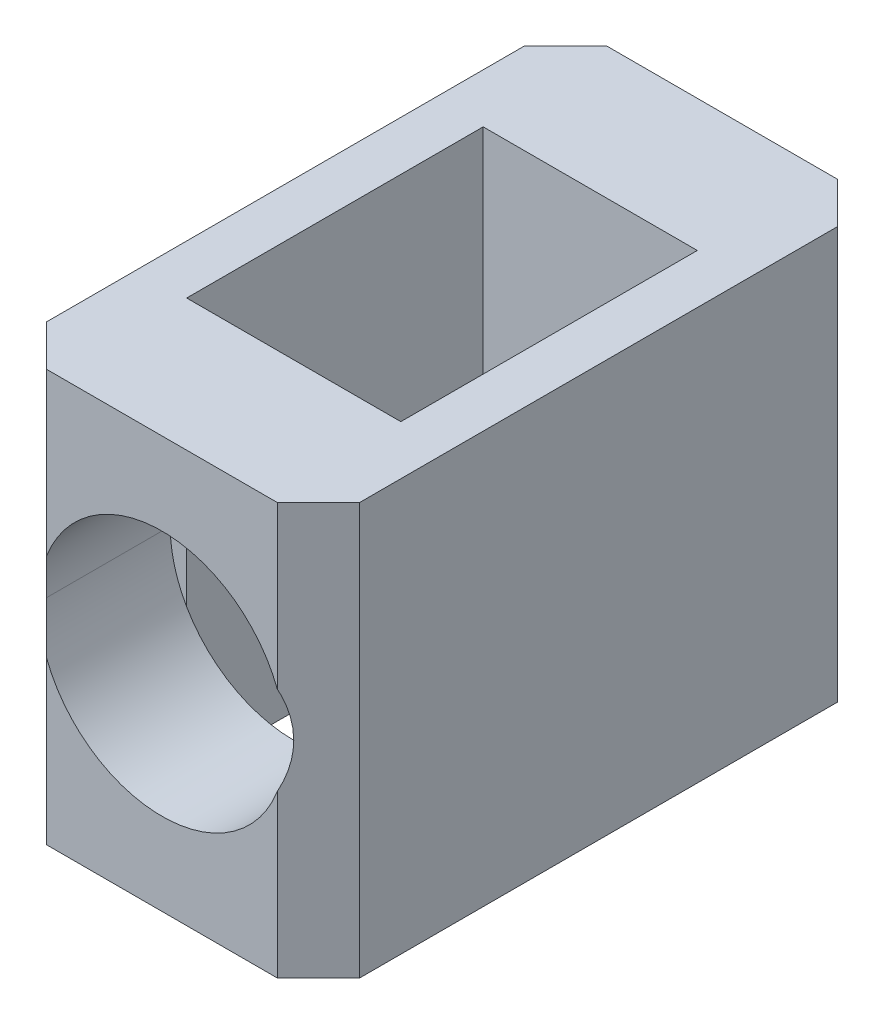
ISO-10303-21;
HEADER;
FILE_DESCRIPTION(('STEP AP214'),'2;1');
FILE_NAME('part.step','',(''),(''),'','','');
FILE_SCHEMA(('AUTOMOTIVE_DESIGN { 1 0 10303 214 1 1 1 1 }'));
ENDSEC;
DATA;
#1=APPLICATION_CONTEXT('core data for automotive mechanical design processes');
#2=APPLICATION_PROTOCOL_DEFINITION('international standard','automotive_design',2000,#1);
#3=PRODUCT_CONTEXT('',#1,'mechanical');
#4=PRODUCT('Part','Part','',(#3));
#5=PRODUCT_RELATED_PRODUCT_CATEGORY('part','',(#4));
#6=PRODUCT_DEFINITION_FORMATION('','',#4);
#7=PRODUCT_DEFINITION_CONTEXT('part definition',#1,'design');
#8=PRODUCT_DEFINITION('design','',#6,#7);
#9=PRODUCT_DEFINITION_SHAPE('','',#8);
#10=(LENGTH_UNIT() NAMED_UNIT(*) SI_UNIT(.MILLI.,.METRE.));
#11=(NAMED_UNIT(*) PLANE_ANGLE_UNIT() SI_UNIT($,.RADIAN.));
#12=(NAMED_UNIT(*) SI_UNIT($,.STERADIAN.) SOLID_ANGLE_UNIT());
#13=UNCERTAINTY_MEASURE_WITH_UNIT(LENGTH_MEASURE(1.E-05),#10,'distance_accuracy_value','');
#14=(GEOMETRIC_REPRESENTATION_CONTEXT(3) GLOBAL_UNCERTAINTY_ASSIGNED_CONTEXT((#13)) GLOBAL_UNIT_ASSIGNED_CONTEXT((#10,
#11,#12)) REPRESENTATION_CONTEXT('',''));
#15=CARTESIAN_POINT('',(0.,0.,0.));
#16=DIRECTION('',(0.,0.,1.));
#17=DIRECTION('',(1.,0.,0.));
#18=AXIS2_PLACEMENT_3D('',#15,#16,#17);
#19=CARTESIAN_POINT('',(22.86,5.27000000000021,8.43));
#20=DIRECTION('',(0.,0.,-1.));
#21=DIRECTION('',(-1.,0.,0.));
#22=AXIS2_PLACEMENT_3D('',#19,#20,#21);
#23=CYLINDRICAL_SURFACE('',#22,1.5);
#24=DIRECTION('',(0.,0.,1.));
#25=VECTOR('',#24,1.);
#26=CARTESIAN_POINT('',(21.3600000000003,5.26999999999963,8.43));
#27=LINE('',#26,#25);
#28=CARTESIAN_POINT('',(21.3600000000003,5.26999999999963,6.83));
#29=VERTEX_POINT('',#28);
#30=CARTESIAN_POINT('',(21.3600000000003,5.26999999999963,8.33));
#31=VERTEX_POINT('',#30);
#32=EDGE_CURVE('E244',#29,#31,#27,.T.);
#33=ORIENTED_EDGE('',*,*,#32,.F.);
#34=CARTESIAN_POINT('',(22.8599999999997,5.27000000000021,6.82999999999992));
#35=DIRECTION('',(0.,0.,1.));
#36=DIRECTION('',(-1.,0.,0.));
#37=AXIS2_PLACEMENT_3D('',#34,#35,#36);
#38=CIRCLE('',#37,1.5);
#39=CARTESIAN_POINT('',(21.56,6.01833147735468,6.83));
#40=VERTEX_POINT('',#39);
#41=EDGE_CURVE('E27',#40,#29,#38,.T.);
#42=ORIENTED_EDGE('',*,*,#41,.F.);
#43=CARTESIAN_POINT('',(22.8599999999997,5.27000000000021,6.83));
#44=DIRECTION('',(0.,0.,1.));
#45=DIRECTION('',(-1.,0.,0.));
#46=AXIS2_PLACEMENT_3D('',#43,#44,#45);
#47=CIRCLE('',#46,1.5);
#48=CARTESIAN_POINT('',(24.16,6.01833147735475,6.82999999999989));
#49=VERTEX_POINT('',#48);
#50=EDGE_CURVE('E379',#49,#40,#47,.T.);
#51=ORIENTED_EDGE('',*,*,#50,.F.);
#52=CARTESIAN_POINT('',(22.8599999999997,5.27000000000021,6.82999999999992));
#53=DIRECTION('',(0.,0.,1.));
#54=DIRECTION('',(-1.,0.,0.));
#55=AXIS2_PLACEMENT_3D('',#52,#53,#54);
#56=CIRCLE('',#55,1.5);
#57=CARTESIAN_POINT('',(24.36,5.27000000000007,6.82999999999989));
#58=VERTEX_POINT('',#57);
#59=EDGE_CURVE('E10',#58,#49,#56,.T.);
#60=ORIENTED_EDGE('',*,*,#59,.F.);
#61=DIRECTION('',(0.,0.,1.));
#62=VECTOR('',#61,1.);
#63=CARTESIAN_POINT('',(24.36,5.27000000000007,8.43));
#64=LINE('',#63,#62);
#65=CARTESIAN_POINT('',(24.36,5.27000000000007,8.32999999999989));
#66=VERTEX_POINT('',#65);
#67=EDGE_CURVE('E316',#58,#66,#64,.T.);
#68=ORIENTED_EDGE('',*,*,#67,.T.);
#69=CARTESIAN_POINT('',(22.86,5.27000000000021,9.83));
#70=DIRECTION('',(0.707106781186561,0.,0.707106781186534));
#71=DIRECTION('',(-0.707106781186534,0.,0.707106781186561));
#72=AXIS2_PLACEMENT_3D('',#69,#70,#71);
#73=ELLIPSE('',#72,2.12132034355964,1.5);
#74=CARTESIAN_POINT('',(24.26,5.80851648071365,8.43));
#75=VERTEX_POINT('',#74);
#76=EDGE_CURVE('E296',#66,#75,#73,.T.);
#77=ORIENTED_EDGE('',*,*,#76,.T.);
#78=CARTESIAN_POINT('',(22.86,5.27000000000021,8.43));
#79=DIRECTION('',(0.,0.,1.));
#80=DIRECTION('',(-1.,0.,0.));
#81=AXIS2_PLACEMENT_3D('',#78,#79,#80);
#82=CIRCLE('',#81,1.5);
#83=CARTESIAN_POINT('',(21.46,5.80851648071329,8.43));
#84=VERTEX_POINT('',#83);
#85=EDGE_CURVE('E376',#75,#84,#82,.T.);
#86=ORIENTED_EDGE('',*,*,#85,.T.);
#87=CARTESIAN_POINT('',(22.86,5.27000000000021,9.83));
#88=DIRECTION('',(-0.707106781186535,0.,0.70710678118656));
#89=DIRECTION('',(0.70710678118656,0.,0.707106781186535));
#90=AXIS2_PLACEMENT_3D('',#87,#88,#89);
#91=ELLIPSE('',#90,2.12132034355964,1.5);
#92=EDGE_CURVE('E273',#84,#31,#91,.T.);
#93=ORIENTED_EDGE('',*,*,#92,.T.);
#94=EDGE_LOOP('',(#33,#42,#51,#60,#68,#77,#86,#93));
#95=FACE_BOUND('',#94,.T.);
#96=ADVANCED_FACE('F16',(#95),#23,.F.);
#97=CARTESIAN_POINT('',(24.1850000000003,5.26999999999963,6.82999999999989));
#98=DIRECTION('',(0.,0.,1.));
#99=DIRECTION('',(1.,0.,0.));
#100=AXIS2_PLACEMENT_3D('',#97,#98,#99);
#101=PLANE('',#100);
#102=DIRECTION('',(0.,-1.,0.));
#103=VECTOR('',#102,1.);
#104=CARTESIAN_POINT('',(24.16,2.77000000000016,6.82999999999989));
#105=LINE('',#104,#103);
#106=CARTESIAN_POINT('',(24.16,4.52166852264494,6.82999999999989));
#107=VERTEX_POINT('',#106);
#108=EDGE_CURVE('E402',#49,#107,#105,.T.);
#109=ORIENTED_EDGE('',*,*,#108,.T.);
#110=CARTESIAN_POINT('',(22.8599999999997,5.27000000000021,6.82999999999992));
#111=DIRECTION('',(0.,0.,1.));
#112=DIRECTION('',(-1.,0.,0.));
#113=AXIS2_PLACEMENT_3D('',#110,#111,#112);
#114=CIRCLE('',#113,1.5);
#115=EDGE_CURVE('E251',#107,#58,#114,.T.);
#116=ORIENTED_EDGE('',*,*,#115,.T.);
#117=ORIENTED_EDGE('',*,*,#59,.T.);
#118=EDGE_LOOP('',(#109,#116,#117));
#119=FACE_BOUND('',#118,.T.);
#120=ADVANCED_FACE('F574',(#119),#101,.T.);
#121=CARTESIAN_POINT('',(24.1850000000003,5.26999999999963,6.82999999999989));
#122=DIRECTION('',(0.,0.,1.));
#123=DIRECTION('',(1.,0.,0.));
#124=AXIS2_PLACEMENT_3D('',#121,#122,#123);
#125=PLANE('',#124);
#126=CARTESIAN_POINT('',(22.8599999999997,5.27000000000021,6.82999999999992));
#127=DIRECTION('',(0.,0.,1.));
#128=DIRECTION('',(-1.,0.,0.));
#129=AXIS2_PLACEMENT_3D('',#126,#127,#128);
#130=CIRCLE('',#129,1.5);
#131=CARTESIAN_POINT('',(21.56,4.52166852264501,6.83));
#132=VERTEX_POINT('',#131);
#133=EDGE_CURVE('E241',#29,#132,#130,.T.);
#134=ORIENTED_EDGE('',*,*,#133,.T.);
#135=DIRECTION('',(0.,1.,0.));
#136=VECTOR('',#135,1.);
#137=CARTESIAN_POINT('',(21.56,2.77000000000016,6.83));
#138=LINE('',#137,#136);
#139=EDGE_CURVE('E304',#132,#40,#138,.T.);
#140=ORIENTED_EDGE('',*,*,#139,.T.);
#141=ORIENTED_EDGE('',*,*,#41,.T.);
#142=EDGE_LOOP('',(#134,#140,#141));
#143=FACE_BOUND('',#142,.T.);
#144=ADVANCED_FACE('F632',(#143),#125,.T.);
#145=CARTESIAN_POINT('',(22.86,5.27000000000021,8.43));
#146=DIRECTION('',(0.,0.,-1.));
#147=DIRECTION('',(-1.,0.,0.));
#148=AXIS2_PLACEMENT_3D('',#145,#146,#147);
#149=CYLINDRICAL_SURFACE('',#148,1.5);
#150=ORIENTED_EDGE('',*,*,#133,.F.);
#151=ORIENTED_EDGE('',*,*,#32,.T.);
#152=CARTESIAN_POINT('',(22.86,5.27000000000021,9.83));
#153=DIRECTION('',(-0.707106781186535,0.,0.70710678118656));
#154=DIRECTION('',(0.70710678118656,0.,0.707106781186535));
#155=AXIS2_PLACEMENT_3D('',#152,#153,#154);
#156=ELLIPSE('',#155,2.12132034355964,1.5);
#157=CARTESIAN_POINT('',(21.46,4.73148351928682,8.43));
#158=VERTEX_POINT('',#157);
#159=EDGE_CURVE('E342',#31,#158,#156,.T.);
#160=ORIENTED_EDGE('',*,*,#159,.T.);
#161=CARTESIAN_POINT('',(22.86,5.27000000000021,8.43));
#162=DIRECTION('',(0.,0.,1.));
#163=DIRECTION('',(-1.,0.,0.));
#164=AXIS2_PLACEMENT_3D('',#161,#162,#163);
#165=CIRCLE('',#164,1.5);
#166=CARTESIAN_POINT('',(24.26,4.73148351928624,8.43));
#167=VERTEX_POINT('',#166);
#168=EDGE_CURVE('E289',#158,#167,#165,.T.);
#169=ORIENTED_EDGE('',*,*,#168,.T.);
#170=CARTESIAN_POINT('',(22.86,5.27000000000021,9.83));
#171=DIRECTION('',(0.707106781186561,0.,0.707106781186534));
#172=DIRECTION('',(-0.707106781186534,0.,0.707106781186561));
#173=AXIS2_PLACEMENT_3D('',#170,#171,#172);
#174=ELLIPSE('',#173,2.12132034355964,1.5);
#175=EDGE_CURVE('E312',#167,#66,#174,.T.);
#176=ORIENTED_EDGE('',*,*,#175,.T.);
#177=ORIENTED_EDGE('',*,*,#67,.F.);
#178=ORIENTED_EDGE('',*,*,#115,.F.);
#179=CARTESIAN_POINT('',(22.8599999999997,5.27000000000021,6.83));
#180=DIRECTION('',(0.,0.,1.));
#181=DIRECTION('',(-1.,0.,0.));
#182=AXIS2_PLACEMENT_3D('',#179,#180,#181);
#183=CIRCLE('',#182,1.5);
#184=EDGE_CURVE('E245',#132,#107,#183,.T.);
#185=ORIENTED_EDGE('',*,*,#184,.F.);
#186=EDGE_LOOP('',(#150,#151,#160,#169,#176,#177,#178,#185));
#187=FACE_BOUND('',#186,.T.);
#188=ADVANCED_FACE('F419',(#187),#149,.F.);
#189=CARTESIAN_POINT('',(23.8599999999996,7.77000000000033,6.83));
#190=DIRECTION('',(0.,0.,1.));
#191=DIRECTION('',(1.,0.,0.));
#192=AXIS2_PLACEMENT_3D('',#189,#190,#191);
#193=PLANE('',#192);
#194=ORIENTED_EDGE('',*,*,#184,.T.);
#195=DIRECTION('',(0.,1.,0.));
#196=VECTOR('',#195,1.);
#197=CARTESIAN_POINT('',(24.16,2.77000000000016,6.83));
#198=LINE('',#197,#196);
#199=CARTESIAN_POINT('',(24.16,2.77000000000016,6.83));
#200=VERTEX_POINT('',#199);
#201=EDGE_CURVE('E20',#200,#107,#198,.T.);
#202=ORIENTED_EDGE('',*,*,#201,.F.);
#203=DIRECTION('',(1.,0.,0.));
#204=VECTOR('',#203,1.);
#205=CARTESIAN_POINT('',(80.7710968965142,2.7700000000002,6.82999999999898));
#206=LINE('',#205,#204);
#207=CARTESIAN_POINT('',(21.56,2.77000000000016,6.83));
#208=VERTEX_POINT('',#207);
#209=EDGE_CURVE('E166',#208,#200,#206,.T.);
#210=ORIENTED_EDGE('',*,*,#209,.F.);
#211=DIRECTION('',(0.,1.,0.));
#212=VECTOR('',#211,1.);
#213=CARTESIAN_POINT('',(21.56,2.77000000000016,6.83));
#214=LINE('',#213,#212);
#215=EDGE_CURVE('E292',#208,#132,#214,.T.);
#216=ORIENTED_EDGE('',*,*,#215,.T.);
#217=EDGE_LOOP('',(#194,#202,#210,#216));
#218=FACE_BOUND('',#217,.T.);
#219=ADVANCED_FACE('F414',(#218),#193,.F.);
#220=CARTESIAN_POINT('',(21.2100000000003,5.26999999999964,8.18));
#221=DIRECTION('',(-0.707106781186534,0.,0.707106781186561));
#222=DIRECTION('',(0.,1.,0.));
#223=AXIS2_PLACEMENT_3D('',#220,#221,#222);
#224=PLANE('',#223);
#225=DIRECTION('',(0.,1.,0.));
#226=VECTOR('',#225,1.);
#227=CARTESIAN_POINT('',(20.96,5.26999999999984,7.93));
#228=LINE('',#227,#226);
#229=CARTESIAN_POINT('',(20.96,2.77000000000016,7.93));
#230=VERTEX_POINT('',#229);
#231=CARTESIAN_POINT('',(20.9600000000003,7.76999999999961,7.93));
#232=VERTEX_POINT('',#231);
#233=EDGE_CURVE('E309',#230,#232,#228,.T.);
#234=ORIENTED_EDGE('',*,*,#233,.F.);
#235=DIRECTION('',(-0.70710678118656,0.,-0.707106781186535));
#236=VECTOR('',#235,1.);
#237=CARTESIAN_POINT('',(-41.760076808694,2.76999999999905,-54.7900768086914));
#238=LINE('',#237,#236);
#239=CARTESIAN_POINT('',(21.4600000000003,2.76999999999965,8.43));
#240=VERTEX_POINT('',#239);
#241=EDGE_CURVE('E336',#240,#230,#238,.T.);
#242=ORIENTED_EDGE('',*,*,#241,.F.);
#243=DIRECTION('',(0.,1.,0.));
#244=VECTOR('',#243,1.);
#245=CARTESIAN_POINT('',(21.46,5.27000000000006,8.43));
#246=LINE('',#245,#244);
#247=EDGE_CURVE('E277',#240,#158,#246,.T.);
#248=ORIENTED_EDGE('',*,*,#247,.T.);
#249=ORIENTED_EDGE('',*,*,#159,.F.);
#250=ORIENTED_EDGE('',*,*,#92,.F.);
#251=DIRECTION('',(0.,1.,0.));
#252=VECTOR('',#251,1.);
#253=CARTESIAN_POINT('',(21.46,5.27000000000006,8.43));
#254=LINE('',#253,#252);
#255=CARTESIAN_POINT('',(21.46,7.76999999999983,8.43));
#256=VERTEX_POINT('',#255);
#257=EDGE_CURVE('E326',#84,#256,#254,.T.);
#258=ORIENTED_EDGE('',*,*,#257,.T.);
#259=DIRECTION('',(-0.70710678118656,0.,-0.707106781186535));
#260=VECTOR('',#259,1.);
#261=CARTESIAN_POINT('',(-41.7600768086941,7.76999999999941,-54.7900768086914));
#262=LINE('',#261,#260);
#263=EDGE_CURVE('E267',#256,#232,#262,.T.);
#264=ORIENTED_EDGE('',*,*,#263,.T.);
#265=EDGE_LOOP('',(#234,#242,#248,#249,#250,#258,#264));
#266=FACE_BOUND('',#265,.T.);
#267=ADVANCED_FACE('F686',(#266),#224,.T.);
#268=CARTESIAN_POINT('',(24.51,5.27,8.18));
#269=DIRECTION('',(0.70710678118656,0.,0.707106781186535));
#270=DIRECTION('',(0.,-1.,0.));
#271=AXIS2_PLACEMENT_3D('',#268,#269,#270);
#272=PLANE('',#271);
#273=DIRECTION('',(0.,-1.,0.));
#274=VECTOR('',#273,1.);
#275=CARTESIAN_POINT('',(24.76,5.26999999999985,7.93));
#276=LINE('',#275,#274);
#277=CARTESIAN_POINT('',(24.7599999999997,7.77000000000023,7.93));
#278=VERTEX_POINT('',#277);
#279=CARTESIAN_POINT('',(24.76,2.77000000000009,7.93));
#280=VERTEX_POINT('',#279);
#281=EDGE_CURVE('E260',#278,#280,#276,.T.);
#282=ORIENTED_EDGE('',*,*,#281,.F.);
#283=DIRECTION('',(-0.707106781186534,0.,0.707106781186561));
#284=VECTOR('',#283,1.);
#285=CARTESIAN_POINT('',(87.4800768086914,7.77000000000049,-54.7900768086937));
#286=LINE('',#285,#284);
#287=CARTESIAN_POINT('',(24.26,7.77,8.43));
#288=VERTEX_POINT('',#287);
#289=EDGE_CURVE('E248',#278,#288,#286,.T.);
#290=ORIENTED_EDGE('',*,*,#289,.T.);
#291=DIRECTION('',(0.,-1.,0.));
#292=VECTOR('',#291,1.);
#293=CARTESIAN_POINT('',(24.2600000000004,5.26999999999964,8.43));
#294=LINE('',#293,#292);
#295=EDGE_CURVE('E330',#288,#75,#294,.T.);
#296=ORIENTED_EDGE('',*,*,#295,.T.);
#297=ORIENTED_EDGE('',*,*,#76,.F.);
#298=ORIENTED_EDGE('',*,*,#175,.F.);
#299=DIRECTION('',(0.,-1.,0.));
#300=VECTOR('',#299,1.);
#301=CARTESIAN_POINT('',(24.2600000000004,5.26999999999964,8.43));
#302=LINE('',#301,#300);
#303=CARTESIAN_POINT('',(24.26,2.76999999999987,8.43));
#304=VERTEX_POINT('',#303);
#305=EDGE_CURVE('E285',#167,#304,#302,.T.);
#306=ORIENTED_EDGE('',*,*,#305,.T.);
#307=DIRECTION('',(-0.707106781186534,0.,0.707106781186561));
#308=VECTOR('',#307,1.);
#309=CARTESIAN_POINT('',(87.4800768086915,2.77000000000048,-54.7900768086937));
#310=LINE('',#309,#308);
#311=EDGE_CURVE('E329',#280,#304,#310,.T.);
#312=ORIENTED_EDGE('',*,*,#311,.F.);
#313=EDGE_LOOP('',(#282,#290,#296,#297,#298,#306,#312));
#314=FACE_BOUND('',#313,.T.);
#315=ADVANCED_FACE('F615',(#314),#272,.T.);
#316=CARTESIAN_POINT('',(21.21,5.26999999999964,1.87999999999996));
#317=DIRECTION('',(-0.70710678118656,0.,-0.707106781186535));
#318=DIRECTION('',(-0.707106781186535,0.,0.70710678118656));
#319=AXIS2_PLACEMENT_3D('',#316,#317,#318);
#320=PLANE('',#319);
#321=DIRECTION('',(0.,-1.,0.));
#322=VECTOR('',#321,1.);
#323=CARTESIAN_POINT('',(20.96,5.26999999999984,2.12999999999996));
#324=LINE('',#323,#322);
#325=CARTESIAN_POINT('',(20.96,7.76999999999961,2.13000000000006));
#326=VERTEX_POINT('',#325);
#327=CARTESIAN_POINT('',(20.9599999999997,2.77000000000016,2.13000000000006));
#328=VERTEX_POINT('',#327);
#329=EDGE_CURVE('E279',#326,#328,#324,.T.);
#330=ORIENTED_EDGE('',*,*,#329,.F.);
#331=DIRECTION('',(0.707106781186534,0.,-0.707106781186561));
#332=VECTOR('',#331,1.);
#333=CARTESIAN_POINT('',(77.8800768086915,7.77000000000034,-54.7900768086936));
#334=LINE('',#333,#332);
#335=CARTESIAN_POINT('',(21.46,7.76999999999983,1.63000000000004));
#336=VERTEX_POINT('',#335);
#337=EDGE_CURVE('E264',#326,#336,#334,.T.);
#338=ORIENTED_EDGE('',*,*,#337,.T.);
#339=DIRECTION('',(0.,-1.,0.));
#340=VECTOR('',#339,1.);
#341=CARTESIAN_POINT('',(21.4599999999997,5.27000000000006,1.62999999999994));
#342=LINE('',#341,#340);
#343=CARTESIAN_POINT('',(21.46,2.76999999999965,1.63000000000004));
#344=VERTEX_POINT('',#343);
#345=EDGE_CURVE('E323',#336,#344,#342,.T.);
#346=ORIENTED_EDGE('',*,*,#345,.T.);
#347=DIRECTION('',(0.707106781186534,0.,-0.707106781186561));
#348=VECTOR('',#347,1.);
#349=CARTESIAN_POINT('',(77.8800768086917,2.77000000000019,-54.7900768086936));
#350=LINE('',#349,#348);
#351=EDGE_CURVE('E147',#328,#344,#350,.T.);
#352=ORIENTED_EDGE('',*,*,#351,.F.);
#353=EDGE_LOOP('',(#330,#338,#346,#352));
#354=FACE_BOUND('',#353,.T.);
#355=ADVANCED_FACE('F611',(#354),#320,.T.);
#356=CARTESIAN_POINT('',(24.51,5.27,1.87999999999989));
#357=DIRECTION('',(0.707106781186535,0.,-0.707106781186561));
#358=DIRECTION('',(0.,-1.,0.));
#359=AXIS2_PLACEMENT_3D('',#356,#357,#358);
#360=PLANE('',#359);
#361=DIRECTION('',(0.,-1.,0.));
#362=VECTOR('',#361,1.);
#363=CARTESIAN_POINT('',(24.26,5.26999999999964,1.6299999999999));
#364=LINE('',#363,#362);
#365=CARTESIAN_POINT('',(24.2599999999997,7.77,1.63));
#366=VERTEX_POINT('',#365);
#367=CARTESIAN_POINT('',(24.26,2.76999999999987,1.63));
#368=VERTEX_POINT('',#367);
#369=EDGE_CURVE('E240',#366,#368,#364,.T.);
#370=ORIENTED_EDGE('',*,*,#369,.F.);
#371=DIRECTION('',(0.70710678118656,0.,0.707106781186535));
#372=VECTOR('',#371,1.);
#373=CARTESIAN_POINT('',(-32.1600768086939,7.76999999999941,-54.7900768086916));
#374=LINE('',#373,#372);
#375=CARTESIAN_POINT('',(24.7599999999996,7.77000000000023,2.13));
#376=VERTEX_POINT('',#375);
#377=EDGE_CURVE('E111',#366,#376,#374,.T.);
#378=ORIENTED_EDGE('',*,*,#377,.T.);
#379=DIRECTION('',(0.,-1.,0.));
#380=VECTOR('',#379,1.);
#381=CARTESIAN_POINT('',(24.76,5.26999999999985,2.12999999999989));
#382=LINE('',#381,#380);
#383=CARTESIAN_POINT('',(24.76,2.77000000000009,2.13));
#384=VERTEX_POINT('',#383);
#385=EDGE_CURVE('E259',#376,#384,#382,.T.);
#386=ORIENTED_EDGE('',*,*,#385,.T.);
#387=DIRECTION('',(0.70710678118656,0.,0.707106781186535));
#388=VECTOR('',#387,1.);
#389=CARTESIAN_POINT('',(-32.1600768086939,2.76999999999905,-54.7900768086916));
#390=LINE('',#389,#388);
#391=EDGE_CURVE('E125',#368,#384,#390,.T.);
#392=ORIENTED_EDGE('',*,*,#391,.F.);
#393=EDGE_LOOP('',(#370,#378,#386,#392));
#394=FACE_BOUND('',#393,.T.);
#395=ADVANCED_FACE('F583',(#394),#360,.T.);
#396=CARTESIAN_POINT('',(80.7710968965131,2.77000000000019,-54.7900768086936));
#397=DIRECTION('',(0.,1.,0.));
#398=DIRECTION('',(1.,0.,0.));
#399=AXIS2_PLACEMENT_3D('',#396,#397,#398);
#400=PLANE('',#399);
#401=DIRECTION('',(0.,0.,1.));
#402=VECTOR('',#401,1.);
#403=CARTESIAN_POINT('',(21.5599999999988,2.77000000000015,-54.7900768086926));
#404=LINE('',#403,#402);
#405=CARTESIAN_POINT('',(21.56,2.77000000000016,3.22999999999994));
#406=VERTEX_POINT('',#405);
#407=EDGE_CURVE('E212',#406,#208,#404,.T.);
#408=ORIENTED_EDGE('',*,*,#407,.T.);
#409=ORIENTED_EDGE('',*,*,#209,.T.);
#410=DIRECTION('',(0.,0.,-1.));
#411=VECTOR('',#410,1.);
#412=CARTESIAN_POINT('',(24.1599999999987,2.77000000000015,-54.7900768086926));
#413=LINE('',#412,#411);
#414=CARTESIAN_POINT('',(24.16,2.77000000000016,3.22999999999989));
#415=VERTEX_POINT('',#414);
#416=EDGE_CURVE('E203',#200,#415,#413,.T.);
#417=ORIENTED_EDGE('',*,*,#416,.T.);
#418=DIRECTION('',(-1.,0.,0.));
#419=VECTOR('',#418,1.);
#420=CARTESIAN_POINT('',(80.7710968965141,2.7700000000002,3.22999999999887));
#421=LINE('',#420,#419);
#422=EDGE_CURVE('E207',#415,#406,#421,.T.);
#423=ORIENTED_EDGE('',*,*,#422,.T.);
#424=EDGE_LOOP('',(#408,#409,#417,#423));
#425=FACE_BOUND('',#424,.T.);
#426=DIRECTION('',(0.,0.,-1.));
#427=VECTOR('',#426,1.);
#428=CARTESIAN_POINT('',(24.7599999999988,2.77000000000008,-54.7900768086926));
#429=LINE('',#428,#427);
#430=EDGE_CURVE('E256',#280,#384,#429,.T.);
#431=ORIENTED_EDGE('',*,*,#430,.F.);
#432=ORIENTED_EDGE('',*,*,#311,.T.);
#433=DIRECTION('',(-1.,0.,0.));
#434=VECTOR('',#433,1.);
#435=CARTESIAN_POINT('',(80.7710968965142,2.7700000000002,8.42999999999897));
#436=LINE('',#435,#434);
#437=EDGE_CURVE('E274',#304,#240,#436,.T.);
#438=ORIENTED_EDGE('',*,*,#437,.T.);
#439=ORIENTED_EDGE('',*,*,#241,.T.);
#440=DIRECTION('',(0.,0.,-1.));
#441=VECTOR('',#440,1.);
#442=CARTESIAN_POINT('',(20.9599999999987,2.77000000000016,-54.7900768086925));
#443=LINE('',#442,#441);
#444=EDGE_CURVE('E283',#230,#328,#443,.T.);
#445=ORIENTED_EDGE('',*,*,#444,.T.);
#446=ORIENTED_EDGE('',*,*,#351,.T.);
#447=DIRECTION('',(-1.,0.,0.));
#448=VECTOR('',#447,1.);
#449=CARTESIAN_POINT('',(80.7710968965141,2.7700000000002,1.62999999999888));
#450=LINE('',#449,#448);
#451=EDGE_CURVE('E319',#368,#344,#450,.T.);
#452=ORIENTED_EDGE('',*,*,#451,.F.);
#453=ORIENTED_EDGE('',*,*,#391,.T.);
#454=EDGE_LOOP('',(#431,#432,#438,#439,#445,#446,#452,#453));
#455=FACE_BOUND('',#454,.T.);
#456=ADVANCED_FACE('F205',(#425,#455),#400,.F.);
#457=CARTESIAN_POINT('',(24.0600000000003,2.76999999999965,8.43));
#458=DIRECTION('',(0.,0.,1.));
#459=DIRECTION('',(1.,0.,0.));
#460=AXIS2_PLACEMENT_3D('',#457,#458,#459);
#461=PLANE('',#460);
#462=ORIENTED_EDGE('',*,*,#85,.F.);
#463=ORIENTED_EDGE('',*,*,#295,.F.);
#464=DIRECTION('',(-1.,0.,0.));
#465=VECTOR('',#464,1.);
#466=CARTESIAN_POINT('',(80.771096896514,7.77000000000035,8.42999999999897));
#467=LINE('',#466,#465);
#468=EDGE_CURVE('E255',#288,#256,#467,.T.);
#469=ORIENTED_EDGE('',*,*,#468,.T.);
#470=ORIENTED_EDGE('',*,*,#257,.F.);
#471=EDGE_LOOP('',(#462,#463,#469,#470));
#472=FACE_BOUND('',#471,.T.);
#473=ADVANCED_FACE('F564',(#472),#461,.T.);
#474=CARTESIAN_POINT('',(23.8599999999996,7.77000000000033,6.83));
#475=DIRECTION('',(0.,0.,1.));
#476=DIRECTION('',(1.,0.,0.));
#477=AXIS2_PLACEMENT_3D('',#474,#475,#476);
#478=PLANE('',#477);
#479=DIRECTION('',(0.,1.,0.));
#480=VECTOR('',#479,1.);
#481=CARTESIAN_POINT('',(24.16,2.77000000000016,6.83));
#482=LINE('',#481,#480);
#483=CARTESIAN_POINT('',(24.1599999999996,7.77000000000031,6.83));
#484=VERTEX_POINT('',#483);
#485=EDGE_CURVE('E300',#49,#484,#482,.T.);
#486=ORIENTED_EDGE('',*,*,#485,.F.);
#487=ORIENTED_EDGE('',*,*,#50,.T.);
#488=DIRECTION('',(0.,1.,0.));
#489=VECTOR('',#488,1.);
#490=CARTESIAN_POINT('',(21.56,2.77000000000016,6.83));
#491=LINE('',#490,#489);
#492=CARTESIAN_POINT('',(21.5599999999997,7.77000000000031,6.83));
#493=VERTEX_POINT('',#492);
#494=EDGE_CURVE('E301',#40,#493,#491,.T.);
#495=ORIENTED_EDGE('',*,*,#494,.T.);
#496=DIRECTION('',(1.,0.,0.));
#497=VECTOR('',#496,1.);
#498=CARTESIAN_POINT('',(80.7710968965139,7.77000000000035,6.82999999999898));
#499=LINE('',#498,#497);
#500=EDGE_CURVE('E135',#493,#484,#499,.T.);
#501=ORIENTED_EDGE('',*,*,#500,.T.);
#502=EDGE_LOOP('',(#486,#487,#495,#501));
#503=FACE_BOUND('',#502,.T.);
#504=ADVANCED_FACE('F557',(#503),#478,.F.);
#505=CARTESIAN_POINT('',(21.66,2.76999999999987,1.62999999999994));
#506=DIRECTION('',(0.,0.,-1.));
#507=DIRECTION('',(-1.,0.,0.));
#508=AXIS2_PLACEMENT_3D('',#505,#506,#507);
#509=PLANE('',#508);
#510=ORIENTED_EDGE('',*,*,#369,.T.);
#511=ORIENTED_EDGE('',*,*,#451,.T.);
#512=ORIENTED_EDGE('',*,*,#345,.F.);
#513=DIRECTION('',(-1.,0.,0.));
#514=VECTOR('',#513,1.);
#515=CARTESIAN_POINT('',(80.7710968965139,7.77000000000035,1.62999999999888));
#516=LINE('',#515,#514);
#517=EDGE_CURVE('E268',#366,#336,#516,.T.);
#518=ORIENTED_EDGE('',*,*,#517,.F.);
#519=EDGE_LOOP('',(#510,#511,#512,#518));
#520=FACE_BOUND('',#519,.T.);
#521=ADVANCED_FACE('F563',(#520),#509,.T.);
#522=CARTESIAN_POINT('',(21.8516410670894,7.76999999999981,7.62205114905214));
#523=DIRECTION('',(0.,1.,0.));
#524=DIRECTION('',(1.,0.,0.));
#525=AXIS2_PLACEMENT_3D('',#522,#523,#524);
#526=PLANE('',#525);
#527=DIRECTION('',(-1.,0.,0.));
#528=VECTOR('',#527,1.);
#529=CARTESIAN_POINT('',(80.7710968965139,7.77000000000035,3.22999999999887));
#530=LINE('',#529,#528);
#531=CARTESIAN_POINT('',(24.1599999999995,7.77000000000031,3.22999999999989));
#532=VERTEX_POINT('',#531);
#533=CARTESIAN_POINT('',(21.5599999999996,7.77000000000031,3.22999999999994));
#534=VERTEX_POINT('',#533);
#535=EDGE_CURVE('E223',#532,#534,#530,.T.);
#536=ORIENTED_EDGE('',*,*,#535,.F.);
#537=DIRECTION('',(0.,0.,-1.));
#538=VECTOR('',#537,1.);
#539=CARTESIAN_POINT('',(24.1599999999985,7.7700000000003,-54.7900768086926));
#540=LINE('',#539,#538);
#541=EDGE_CURVE('E218',#484,#532,#540,.T.);
#542=ORIENTED_EDGE('',*,*,#541,.F.);
#543=ORIENTED_EDGE('',*,*,#500,.F.);
#544=DIRECTION('',(0.,0.,1.));
#545=VECTOR('',#544,1.);
#546=CARTESIAN_POINT('',(21.5599999999985,7.7700000000003,-54.7900768086926));
#547=LINE('',#546,#545);
#548=EDGE_CURVE('E305',#534,#493,#547,.T.);
#549=ORIENTED_EDGE('',*,*,#548,.F.);
#550=EDGE_LOOP('',(#536,#542,#543,#549));
#551=FACE_BOUND('',#550,.T.);
#552=ORIENTED_EDGE('',*,*,#517,.T.);
#553=ORIENTED_EDGE('',*,*,#337,.F.);
#554=DIRECTION('',(0.,0.,-1.));
#555=VECTOR('',#554,1.);
#556=CARTESIAN_POINT('',(20.9599999999992,7.7699999999996,-54.7900768086925));
#557=LINE('',#556,#555);
#558=EDGE_CURVE('E284',#232,#326,#557,.T.);
#559=ORIENTED_EDGE('',*,*,#558,.F.);
#560=ORIENTED_EDGE('',*,*,#263,.F.);
#561=ORIENTED_EDGE('',*,*,#468,.F.);
#562=ORIENTED_EDGE('',*,*,#289,.F.);
#563=DIRECTION('',(0.,0.,-1.));
#564=VECTOR('',#563,1.);
#565=CARTESIAN_POINT('',(24.7599999999986,7.77000000000022,-54.7900768086926));
#566=LINE('',#565,#564);
#567=EDGE_CURVE('E263',#278,#376,#566,.T.);
#568=ORIENTED_EDGE('',*,*,#567,.T.);
#569=ORIENTED_EDGE('',*,*,#377,.F.);
#570=EDGE_LOOP('',(#552,#553,#559,#560,#561,#562,#568,#569));
#571=FACE_BOUND('',#570,.T.);
#572=ADVANCED_FACE('F18',(#551,#571),#526,.T.);
#573=CARTESIAN_POINT('',(24.76,2.77000000000009,2.33));
#574=DIRECTION('',(1.,0.,0.));
#575=DIRECTION('',(0.,0.,-1.));
#576=AXIS2_PLACEMENT_3D('',#573,#574,#575);
#577=PLANE('',#576);
#578=ORIENTED_EDGE('',*,*,#281,.T.);
#579=ORIENTED_EDGE('',*,*,#430,.T.);
#580=ORIENTED_EDGE('',*,*,#385,.F.);
#581=ORIENTED_EDGE('',*,*,#567,.F.);
#582=EDGE_LOOP('',(#578,#579,#580,#581));
#583=FACE_BOUND('',#582,.T.);
#584=ADVANCED_FACE('F641',(#583),#577,.T.);
#585=CARTESIAN_POINT('',(24.0600000000003,2.76999999999965,8.43));
#586=DIRECTION('',(0.,0.,1.));
#587=DIRECTION('',(1.,0.,0.));
#588=AXIS2_PLACEMENT_3D('',#585,#586,#587);
#589=PLANE('',#588);
#590=ORIENTED_EDGE('',*,*,#305,.F.);
#591=ORIENTED_EDGE('',*,*,#168,.F.);
#592=ORIENTED_EDGE('',*,*,#247,.F.);
#593=ORIENTED_EDGE('',*,*,#437,.F.);
#594=EDGE_LOOP('',(#590,#591,#592,#593));
#595=FACE_BOUND('',#594,.T.);
#596=ADVANCED_FACE('F593',(#595),#589,.T.);
#597=CARTESIAN_POINT('',(24.1599999999995,7.77000000000031,3.53));
#598=DIRECTION('',(1.,0.,0.));
#599=DIRECTION('',(0.,0.,-1.));
#600=AXIS2_PLACEMENT_3D('',#597,#598,#599);
#601=PLANE('',#600);
#602=DIRECTION('',(0.,1.,0.));
#603=VECTOR('',#602,1.);
#604=CARTESIAN_POINT('',(24.16,2.77000000000016,3.22999999999989));
#605=LINE('',#604,#603);
#606=EDGE_CURVE('E215',#415,#532,#605,.T.);
#607=ORIENTED_EDGE('',*,*,#606,.F.);
#608=ORIENTED_EDGE('',*,*,#416,.F.);
#609=ORIENTED_EDGE('',*,*,#201,.T.);
#610=ORIENTED_EDGE('',*,*,#108,.F.);
#611=ORIENTED_EDGE('',*,*,#485,.T.);
#612=ORIENTED_EDGE('',*,*,#541,.T.);
#613=EDGE_LOOP('',(#607,#608,#609,#610,#611,#612));
#614=FACE_BOUND('',#613,.T.);
#615=ADVANCED_FACE('F216',(#614),#601,.F.);
#616=CARTESIAN_POINT('',(21.5599999999996,7.77000000000031,3.53));
#617=DIRECTION('',(-1.,0.,0.));
#618=DIRECTION('',(0.,1.,0.));
#619=AXIS2_PLACEMENT_3D('',#616,#617,#618);
#620=PLANE('',#619);
#621=ORIENTED_EDGE('',*,*,#548,.T.);
#622=ORIENTED_EDGE('',*,*,#494,.F.);
#623=ORIENTED_EDGE('',*,*,#139,.F.);
#624=ORIENTED_EDGE('',*,*,#215,.F.);
#625=ORIENTED_EDGE('',*,*,#407,.F.);
#626=DIRECTION('',(0.,1.,0.));
#627=VECTOR('',#626,1.);
#628=CARTESIAN_POINT('',(21.56,2.77000000000016,3.22999999999994));
#629=LINE('',#628,#627);
#630=EDGE_CURVE('E227',#406,#534,#629,.T.);
#631=ORIENTED_EDGE('',*,*,#630,.T.);
#632=EDGE_LOOP('',(#621,#622,#623,#624,#625,#631));
#633=FACE_BOUND('',#632,.T.);
#634=ADVANCED_FACE('F435',(#633),#620,.F.);
#635=CARTESIAN_POINT('',(20.96,2.77000000000016,7.73));
#636=DIRECTION('',(-1.,0.,0.));
#637=DIRECTION('',(0.,1.,0.));
#638=AXIS2_PLACEMENT_3D('',#635,#636,#637);
#639=PLANE('',#638);
#640=ORIENTED_EDGE('',*,*,#233,.T.);
#641=ORIENTED_EDGE('',*,*,#558,.T.);
#642=ORIENTED_EDGE('',*,*,#329,.T.);
#643=ORIENTED_EDGE('',*,*,#444,.F.);
#644=EDGE_LOOP('',(#640,#641,#642,#643));
#645=FACE_BOUND('',#644,.T.);
#646=ADVANCED_FACE('F600',(#645),#639,.T.);
#647=CARTESIAN_POINT('',(21.8599999999996,7.77000000000026,3.22999999999994));
#648=DIRECTION('',(0.,0.,-1.));
#649=DIRECTION('',(-1.,0.,0.));
#650=AXIS2_PLACEMENT_3D('',#647,#648,#649);
#651=PLANE('',#650);
#652=ORIENTED_EDGE('',*,*,#630,.F.);
#653=ORIENTED_EDGE('',*,*,#422,.F.);
#654=ORIENTED_EDGE('',*,*,#606,.T.);
#655=ORIENTED_EDGE('',*,*,#535,.T.);
#656=EDGE_LOOP('',(#652,#653,#654,#655));
#657=FACE_BOUND('',#656,.T.);
#658=ADVANCED_FACE('F225',(#657),#651,.F.);
#659=CLOSED_SHELL('',(#96,#120,#144,#188,#219,#267,#315,#355,#395,#456,#473,#504,#521,#572,#584,
#596,#615,#634,#646,#658));
#660=MANIFOLD_SOLID_BREP('B1',#659);
#661=ADVANCED_BREP_SHAPE_REPRESENTATION('',(#18,#660),#14);
#662=SHAPE_DEFINITION_REPRESENTATION(#9,#661);
ENDSEC;
END-ISO-10303-21;
